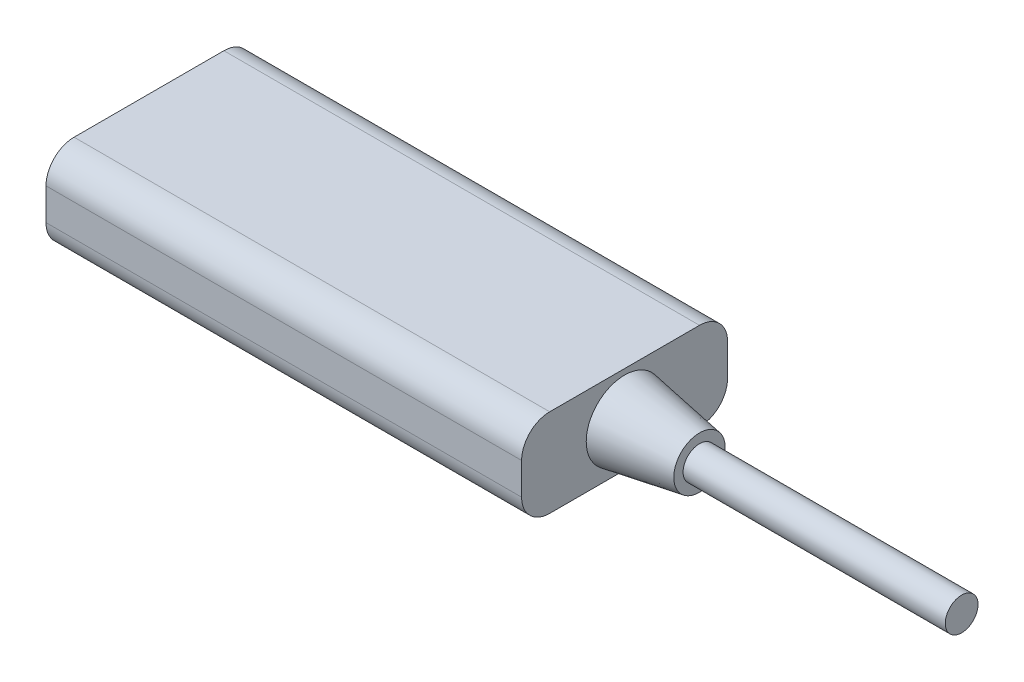
ISO-10303-21;
HEADER;
FILE_DESCRIPTION(('STEP AP214'),'2;1');
FILE_NAME('part.step','',(''),(''),'','','');
FILE_SCHEMA(('AUTOMOTIVE_DESIGN { 1 0 10303 214 1 1 1 1 }'));
ENDSEC;
DATA;
#1=APPLICATION_CONTEXT('core data for automotive mechanical design processes');
#2=APPLICATION_PROTOCOL_DEFINITION('international standard','automotive_design',2000,#1);
#3=PRODUCT_CONTEXT('',#1,'mechanical');
#4=PRODUCT('Part','Part','',(#3));
#5=PRODUCT_RELATED_PRODUCT_CATEGORY('part','',(#4));
#6=PRODUCT_DEFINITION_FORMATION('','',#4);
#7=PRODUCT_DEFINITION_CONTEXT('part definition',#1,'design');
#8=PRODUCT_DEFINITION('design','',#6,#7);
#9=PRODUCT_DEFINITION_SHAPE('','',#8);
#10=(LENGTH_UNIT() NAMED_UNIT(*) SI_UNIT(.MILLI.,.METRE.));
#11=(NAMED_UNIT(*) PLANE_ANGLE_UNIT() SI_UNIT($,.RADIAN.));
#12=(NAMED_UNIT(*) SI_UNIT($,.STERADIAN.) SOLID_ANGLE_UNIT());
#13=UNCERTAINTY_MEASURE_WITH_UNIT(LENGTH_MEASURE(1.E-05),#10,'distance_accuracy_value','');
#14=(GEOMETRIC_REPRESENTATION_CONTEXT(3) GLOBAL_UNCERTAINTY_ASSIGNED_CONTEXT((#13)) GLOBAL_UNIT_ASSIGNED_CONTEXT((#10,
#11,#12)) REPRESENTATION_CONTEXT('',''));
#15=CARTESIAN_POINT('',(0.,0.,0.));
#16=DIRECTION('',(0.,0.,1.));
#17=DIRECTION('',(1.,0.,0.));
#18=AXIS2_PLACEMENT_3D('',#15,#16,#17);
#19=CARTESIAN_POINT('',(-50.8,-4.7,-11.));
#20=DIRECTION('',(0.,-1.,0.));
#21=DIRECTION('',(0.,0.,-1.));
#22=AXIS2_PLACEMENT_3D('',#19,#20,#21);
#23=PLANE('',#22);
#24=DIRECTION('',(0.,0.,-1.));
#25=VECTOR('',#24,1.);
#26=CARTESIAN_POINT('',(-50.8,-4.7,-11.));
#27=LINE('',#26,#25);
#28=CARTESIAN_POINT('',(-50.8,-4.7,8.));
#29=VERTEX_POINT('',#28);
#30=CARTESIAN_POINT('',(-50.8,-4.7,-8.));
#31=VERTEX_POINT('',#30);
#32=EDGE_CURVE('E163',#29,#31,#27,.T.);
#33=ORIENTED_EDGE('',*,*,#32,.T.);
#34=DIRECTION('',(1.,0.,0.));
#35=VECTOR('',#34,1.);
#36=CARTESIAN_POINT('',(-50.8,-4.7,-8.));
#37=LINE('',#36,#35);
#38=CARTESIAN_POINT('',(0.,-4.7,-8.));
#39=VERTEX_POINT('',#38);
#40=EDGE_CURVE('E118',#31,#39,#37,.T.);
#41=ORIENTED_EDGE('',*,*,#40,.T.);
#42=DIRECTION('',(0.,0.,-1.));
#43=VECTOR('',#42,1.);
#44=CARTESIAN_POINT('',(0.,-4.7,-11.));
#45=LINE('',#44,#43);
#46=CARTESIAN_POINT('',(0.,-4.7,8.));
#47=VERTEX_POINT('',#46);
#48=EDGE_CURVE('E103',#47,#39,#45,.T.);
#49=ORIENTED_EDGE('',*,*,#48,.F.);
#50=DIRECTION('',(1.,0.,0.));
#51=VECTOR('',#50,1.);
#52=CARTESIAN_POINT('',(-50.8,-4.7,8.));
#53=LINE('',#52,#51);
#54=EDGE_CURVE('E115',#47,#29,#53,.F.);
#55=ORIENTED_EDGE('',*,*,#54,.T.);
#56=EDGE_LOOP('',(#33,#41,#49,#55));
#57=FACE_BOUND('',#56,.T.);
#58=ADVANCED_FACE('F33',(#57),#23,.T.);
#59=CARTESIAN_POINT('',(-50.8,-4.7,11.));
#60=DIRECTION('',(0.,0.,1.));
#61=DIRECTION('',(1.,0.,0.));
#62=AXIS2_PLACEMENT_3D('',#59,#60,#61);
#63=PLANE('',#62);
#64=DIRECTION('',(0.,-1.,0.));
#65=VECTOR('',#64,1.);
#66=CARTESIAN_POINT('',(-50.8,-4.7,11.));
#67=LINE('',#66,#65);
#68=CARTESIAN_POINT('',(-50.8,1.7,11.));
#69=VERTEX_POINT('',#68);
#70=CARTESIAN_POINT('',(-50.8,-1.7,11.));
#71=VERTEX_POINT('',#70);
#72=EDGE_CURVE('E125',#69,#71,#67,.T.);
#73=ORIENTED_EDGE('',*,*,#72,.T.);
#74=DIRECTION('',(1.,0.,0.));
#75=VECTOR('',#74,1.);
#76=CARTESIAN_POINT('',(-50.8,-1.7,11.));
#77=LINE('',#76,#75);
#78=CARTESIAN_POINT('',(0.,-1.7,11.));
#79=VERTEX_POINT('',#78);
#80=EDGE_CURVE('E11',#71,#79,#77,.T.);
#81=ORIENTED_EDGE('',*,*,#80,.T.);
#82=DIRECTION('',(0.,-1.,0.));
#83=VECTOR('',#82,1.);
#84=CARTESIAN_POINT('',(0.,-4.7,11.));
#85=LINE('',#84,#83);
#86=CARTESIAN_POINT('',(0.,1.7,11.));
#87=VERTEX_POINT('',#86);
#88=EDGE_CURVE('E105',#87,#79,#85,.T.);
#89=ORIENTED_EDGE('',*,*,#88,.F.);
#90=DIRECTION('',(1.,0.,0.));
#91=VECTOR('',#90,1.);
#92=CARTESIAN_POINT('',(-50.8,1.7,11.));
#93=LINE('',#92,#91);
#94=EDGE_CURVE('E41',#87,#69,#93,.F.);
#95=ORIENTED_EDGE('',*,*,#94,.T.);
#96=EDGE_LOOP('',(#73,#81,#89,#95));
#97=FACE_BOUND('',#96,.T.);
#98=ADVANCED_FACE('F154',(#97),#63,.T.);
#99=CARTESIAN_POINT('',(-50.8,4.7,-11.));
#100=DIRECTION('',(0.,1.,0.));
#101=DIRECTION('',(0.,0.,1.));
#102=AXIS2_PLACEMENT_3D('',#99,#100,#101);
#103=PLANE('',#102);
#104=DIRECTION('',(0.,0.,1.));
#105=VECTOR('',#104,1.);
#106=CARTESIAN_POINT('',(0.,4.7,-11.));
#107=LINE('',#106,#105);
#108=CARTESIAN_POINT('',(0.,4.7,-8.));
#109=VERTEX_POINT('',#108);
#110=CARTESIAN_POINT('',(0.,4.7,8.));
#111=VERTEX_POINT('',#110);
#112=EDGE_CURVE('E161',#109,#111,#107,.T.);
#113=ORIENTED_EDGE('',*,*,#112,.F.);
#114=DIRECTION('',(1.,0.,0.));
#115=VECTOR('',#114,1.);
#116=CARTESIAN_POINT('',(-50.8,4.7,-8.));
#117=LINE('',#116,#115);
#118=CARTESIAN_POINT('',(-50.8,4.7,-8.));
#119=VERTEX_POINT('',#118);
#120=EDGE_CURVE('E55',#109,#119,#117,.F.);
#121=ORIENTED_EDGE('',*,*,#120,.T.);
#122=DIRECTION('',(0.,0.,1.));
#123=VECTOR('',#122,1.);
#124=CARTESIAN_POINT('',(-50.8,4.7,-11.));
#125=LINE('',#124,#123);
#126=CARTESIAN_POINT('',(-50.8,4.7,8.));
#127=VERTEX_POINT('',#126);
#128=EDGE_CURVE('E129',#119,#127,#125,.T.);
#129=ORIENTED_EDGE('',*,*,#128,.T.);
#130=DIRECTION('',(1.,0.,0.));
#131=VECTOR('',#130,1.);
#132=CARTESIAN_POINT('',(-50.8,4.7,8.));
#133=LINE('',#132,#131);
#134=EDGE_CURVE('E149',#127,#111,#133,.T.);
#135=ORIENTED_EDGE('',*,*,#134,.T.);
#136=EDGE_LOOP('',(#113,#121,#129,#135));
#137=FACE_BOUND('',#136,.T.);
#138=ADVANCED_FACE('F160',(#137),#103,.T.);
#139=CARTESIAN_POINT('',(-50.8,-4.7,-11.));
#140=DIRECTION('',(0.,0.,-1.));
#141=DIRECTION('',(-1.,0.,0.));
#142=AXIS2_PLACEMENT_3D('',#139,#140,#141);
#143=PLANE('',#142);
#144=DIRECTION('',(0.,1.,0.));
#145=VECTOR('',#144,1.);
#146=CARTESIAN_POINT('',(0.,-4.7,-11.));
#147=LINE('',#146,#145);
#148=CARTESIAN_POINT('',(0.,-1.7,-11.));
#149=VERTEX_POINT('',#148);
#150=CARTESIAN_POINT('',(0.,1.7,-11.));
#151=VERTEX_POINT('',#150);
#152=EDGE_CURVE('E119',#149,#151,#147,.T.);
#153=ORIENTED_EDGE('',*,*,#152,.F.);
#154=DIRECTION('',(1.,0.,0.));
#155=VECTOR('',#154,1.);
#156=CARTESIAN_POINT('',(-50.8,-1.7,-11.));
#157=LINE('',#156,#155);
#158=CARTESIAN_POINT('',(-50.8,-1.7,-11.));
#159=VERTEX_POINT('',#158);
#160=EDGE_CURVE('E141',#149,#159,#157,.F.);
#161=ORIENTED_EDGE('',*,*,#160,.T.);
#162=DIRECTION('',(0.,1.,0.));
#163=VECTOR('',#162,1.);
#164=CARTESIAN_POINT('',(-50.8,-4.7,-11.));
#165=LINE('',#164,#163);
#166=CARTESIAN_POINT('',(-50.8,1.7,-11.));
#167=VERTEX_POINT('',#166);
#168=EDGE_CURVE('E167',#159,#167,#165,.T.);
#169=ORIENTED_EDGE('',*,*,#168,.T.);
#170=DIRECTION('',(1.,0.,0.));
#171=VECTOR('',#170,1.);
#172=CARTESIAN_POINT('',(-50.8,1.7,-11.));
#173=LINE('',#172,#171);
#174=EDGE_CURVE('E138',#167,#151,#173,.T.);
#175=ORIENTED_EDGE('',*,*,#174,.T.);
#176=EDGE_LOOP('',(#153,#161,#169,#175));
#177=FACE_BOUND('',#176,.T.);
#178=ADVANCED_FACE('F206',(#177),#143,.T.);
#179=CARTESIAN_POINT('',(-50.8,0.,0.));
#180=DIRECTION('',(-1.,0.,0.));
#181=DIRECTION('',(0.,0.,1.));
#182=AXIS2_PLACEMENT_3D('',#179,#180,#181);
#183=PLANE('',#182);
#184=CARTESIAN_POINT('',(-50.8,0.600000000000005,-4.4));
#185=DIRECTION('',(-1.,0.,0.));
#186=DIRECTION('',(0.,0.,1.));
#187=AXIS2_PLACEMENT_3D('',#184,#185,#186);
#188=CIRCLE('',#187,1.65);
#189=CARTESIAN_POINT('',(-50.8,0.600000000000005,-2.75));
#190=VERTEX_POINT('',#189);
#191=EDGE_CURVE('E189',#190,#190,#188,.T.);
#192=ORIENTED_EDGE('',*,*,#191,.F.);
#193=EDGE_LOOP('',(#192));
#194=FACE_BOUND('',#193,.T.);
#195=CARTESIAN_POINT('',(-50.8,0.600000000000006,4.4));
#196=DIRECTION('',(-1.,0.,0.));
#197=DIRECTION('',(0.,0.,1.));
#198=AXIS2_PLACEMENT_3D('',#195,#196,#197);
#199=CIRCLE('',#198,1.65);
#200=CARTESIAN_POINT('',(-50.8,0.600000000000006,6.05));
#201=VERTEX_POINT('',#200);
#202=EDGE_CURVE('E183',#201,#201,#199,.T.);
#203=ORIENTED_EDGE('',*,*,#202,.F.);
#204=EDGE_LOOP('',(#203));
#205=FACE_BOUND('',#204,.T.);
#206=ORIENTED_EDGE('',*,*,#168,.F.);
#207=CARTESIAN_POINT('',(-50.8,-1.7,-8.));
#208=DIRECTION('',(-1.,0.,0.));
#209=DIRECTION('',(0.,0.,1.));
#210=AXIS2_PLACEMENT_3D('',#207,#208,#209);
#211=CIRCLE('',#210,3.);
#212=EDGE_CURVE('E147',#159,#31,#211,.T.);
#213=ORIENTED_EDGE('',*,*,#212,.T.);
#214=ORIENTED_EDGE('',*,*,#32,.F.);
#215=CARTESIAN_POINT('',(-50.8,-1.7,8.));
#216=DIRECTION('',(-1.,0.,0.));
#217=DIRECTION('',(0.,0.,1.));
#218=AXIS2_PLACEMENT_3D('',#215,#216,#217);
#219=CIRCLE('',#218,3.);
#220=EDGE_CURVE('E124',#29,#71,#219,.T.);
#221=ORIENTED_EDGE('',*,*,#220,.T.);
#222=ORIENTED_EDGE('',*,*,#72,.F.);
#223=CARTESIAN_POINT('',(-50.8,1.7,8.));
#224=DIRECTION('',(-1.,0.,0.));
#225=DIRECTION('',(0.,0.,1.));
#226=AXIS2_PLACEMENT_3D('',#223,#224,#225);
#227=CIRCLE('',#226,3.);
#228=EDGE_CURVE('E48',#69,#127,#227,.T.);
#229=ORIENTED_EDGE('',*,*,#228,.T.);
#230=ORIENTED_EDGE('',*,*,#128,.F.);
#231=CARTESIAN_POINT('',(-50.8,1.7,-8.));
#232=DIRECTION('',(-1.,0.,0.));
#233=DIRECTION('',(0.,0.,1.));
#234=AXIS2_PLACEMENT_3D('',#231,#232,#233);
#235=CIRCLE('',#234,3.);
#236=EDGE_CURVE('E145',#119,#167,#235,.T.);
#237=ORIENTED_EDGE('',*,*,#236,.T.);
#238=EDGE_LOOP('',(#206,#213,#214,#221,#222,#229,#230,#237));
#239=FACE_BOUND('',#238,.T.);
#240=ADVANCED_FACE('F157',(#194,#205,#239),#183,.T.);
#241=CARTESIAN_POINT('',(0.,0.,0.));
#242=DIRECTION('',(-1.,0.,0.));
#243=DIRECTION('',(0.,0.,1.));
#244=AXIS2_PLACEMENT_3D('',#241,#242,#243);
#245=PLANE('',#244);
#246=CARTESIAN_POINT('',(0.,0.,0.));
#247=DIRECTION('',(-1.,0.,0.));
#248=DIRECTION('',(0.,0.,1.));
#249=AXIS2_PLACEMENT_3D('',#246,#247,#248);
#250=CIRCLE('',#249,4.1);
#251=CARTESIAN_POINT('',(0.,0.,4.1));
#252=VERTEX_POINT('',#251);
#253=EDGE_CURVE('E120',#252,#252,#250,.T.);
#254=ORIENTED_EDGE('',*,*,#253,.T.);
#255=EDGE_LOOP('',(#254));
#256=FACE_BOUND('',#255,.T.);
#257=ORIENTED_EDGE('',*,*,#48,.T.);
#258=CARTESIAN_POINT('',(0.,-1.7,-8.));
#259=DIRECTION('',(-1.,0.,0.));
#260=DIRECTION('',(0.,0.,1.));
#261=AXIS2_PLACEMENT_3D('',#258,#259,#260);
#262=CIRCLE('',#261,3.);
#263=EDGE_CURVE('E136',#39,#149,#262,.F.);
#264=ORIENTED_EDGE('',*,*,#263,.T.);
#265=ORIENTED_EDGE('',*,*,#152,.T.);
#266=CARTESIAN_POINT('',(0.,1.7,-8.));
#267=DIRECTION('',(-1.,0.,0.));
#268=DIRECTION('',(0.,0.,1.));
#269=AXIS2_PLACEMENT_3D('',#266,#267,#268);
#270=CIRCLE('',#269,3.);
#271=EDGE_CURVE('E109',#151,#109,#270,.F.);
#272=ORIENTED_EDGE('',*,*,#271,.T.);
#273=ORIENTED_EDGE('',*,*,#112,.T.);
#274=CARTESIAN_POINT('',(0.,1.7,8.));
#275=DIRECTION('',(-1.,0.,0.));
#276=DIRECTION('',(0.,0.,1.));
#277=AXIS2_PLACEMENT_3D('',#274,#275,#276);
#278=CIRCLE('',#277,3.);
#279=EDGE_CURVE('E110',#111,#87,#278,.F.);
#280=ORIENTED_EDGE('',*,*,#279,.T.);
#281=ORIENTED_EDGE('',*,*,#88,.T.);
#282=CARTESIAN_POINT('',(0.,-1.7,8.));
#283=DIRECTION('',(-1.,0.,0.));
#284=DIRECTION('',(0.,0.,1.));
#285=AXIS2_PLACEMENT_3D('',#282,#283,#284);
#286=CIRCLE('',#285,3.);
#287=EDGE_CURVE('E100',#79,#47,#286,.F.);
#288=ORIENTED_EDGE('',*,*,#287,.T.);
#289=EDGE_LOOP('',(#257,#264,#265,#272,#273,#280,#281,#288));
#290=FACE_BOUND('',#289,.T.);
#291=ADVANCED_FACE('F102',(#256,#290),#245,.F.);
#292=CARTESIAN_POINT('',(8.,0.,0.));
#293=DIRECTION('',(-1.,0.,0.));
#294=DIRECTION('',(0.,0.,1.));
#295=AXIS2_PLACEMENT_3D('',#292,#293,#294);
#296=CONICAL_SURFACE('',#295,2.75,0.167175017093078);
#297=ORIENTED_EDGE('',*,*,#253,.F.);
#298=EDGE_LOOP('',(#297));
#299=FACE_BOUND('',#298,.T.);
#300=CARTESIAN_POINT('',(8.,0.,0.));
#301=DIRECTION('',(-1.,0.,0.));
#302=DIRECTION('',(0.,0.,1.));
#303=AXIS2_PLACEMENT_3D('',#300,#301,#302);
#304=CIRCLE('',#303,2.75);
#305=CARTESIAN_POINT('',(8.,0.,2.75));
#306=VERTEX_POINT('',#305);
#307=EDGE_CURVE('E179',#306,#306,#304,.T.);
#308=ORIENTED_EDGE('',*,*,#307,.T.);
#309=EDGE_LOOP('',(#308));
#310=FACE_BOUND('',#309,.T.);
#311=ADVANCED_FACE('F292',(#299,#310),#296,.T.);
#312=CARTESIAN_POINT('',(36.,0.,0.));
#313=DIRECTION('',(-1.,0.,0.));
#314=DIRECTION('',(0.,0.,1.));
#315=AXIS2_PLACEMENT_3D('',#312,#313,#314);
#316=PLANE('',#315);
#317=CARTESIAN_POINT('',(36.,0.,0.));
#318=DIRECTION('',(-1.,0.,0.));
#319=DIRECTION('',(0.,0.,1.));
#320=AXIS2_PLACEMENT_3D('',#317,#318,#319);
#321=CIRCLE('',#320,1.75);
#322=CARTESIAN_POINT('',(36.,0.,1.75));
#323=VERTEX_POINT('',#322);
#324=EDGE_CURVE('E173',#323,#323,#321,.T.);
#325=ORIENTED_EDGE('',*,*,#324,.F.);
#326=EDGE_LOOP('',(#325));
#327=FACE_BOUND('',#326,.T.);
#328=ADVANCED_FACE('F300',(#327),#316,.F.);
#329=CARTESIAN_POINT('',(0.,0.,0.));
#330=DIRECTION('',(-1.,0.,0.));
#331=DIRECTION('',(0.,0.,1.));
#332=AXIS2_PLACEMENT_3D('',#329,#330,#331);
#333=CYLINDRICAL_SURFACE('',#332,1.75);
#334=CARTESIAN_POINT('',(8.,0.,0.));
#335=DIRECTION('',(-1.,0.,0.));
#336=DIRECTION('',(0.,0.,1.));
#337=AXIS2_PLACEMENT_3D('',#334,#335,#336);
#338=CIRCLE('',#337,1.75);
#339=CARTESIAN_POINT('',(8.,0.,1.75));
#340=VERTEX_POINT('',#339);
#341=EDGE_CURVE('E176',#340,#340,#338,.T.);
#342=ORIENTED_EDGE('',*,*,#341,.F.);
#343=EDGE_LOOP('',(#342));
#344=FACE_BOUND('',#343,.T.);
#345=ORIENTED_EDGE('',*,*,#324,.T.);
#346=EDGE_LOOP('',(#345));
#347=FACE_BOUND('',#346,.T.);
#348=ADVANCED_FACE('F308',(#344,#347),#333,.T.);
#349=CARTESIAN_POINT('',(8.,0.,0.));
#350=DIRECTION('',(-1.,0.,0.));
#351=DIRECTION('',(0.,0.,1.));
#352=AXIS2_PLACEMENT_3D('',#349,#350,#351);
#353=PLANE('',#352);
#354=ORIENTED_EDGE('',*,*,#307,.F.);
#355=EDGE_LOOP('',(#354));
#356=FACE_BOUND('',#355,.T.);
#357=ORIENTED_EDGE('',*,*,#341,.T.);
#358=EDGE_LOOP('',(#357));
#359=FACE_BOUND('',#358,.T.);
#360=ADVANCED_FACE('F235',(#356,#359),#353,.F.);
#361=CARTESIAN_POINT('',(-50.8,-1.7,-8.));
#362=DIRECTION('',(1.,0.,0.));
#363=DIRECTION('',(0.,0.,-1.));
#364=AXIS2_PLACEMENT_3D('',#361,#362,#363);
#365=CYLINDRICAL_SURFACE('',#364,3.);
#366=ORIENTED_EDGE('',*,*,#212,.F.);
#367=ORIENTED_EDGE('',*,*,#160,.F.);
#368=ORIENTED_EDGE('',*,*,#263,.F.);
#369=ORIENTED_EDGE('',*,*,#40,.F.);
#370=EDGE_LOOP('',(#366,#367,#368,#369));
#371=FACE_BOUND('',#370,.T.);
#372=ADVANCED_FACE('F231',(#371),#365,.T.);
#373=CARTESIAN_POINT('',(-50.8,1.7,-8.));
#374=DIRECTION('',(1.,0.,0.));
#375=DIRECTION('',(0.,0.,-1.));
#376=AXIS2_PLACEMENT_3D('',#373,#374,#375);
#377=CYLINDRICAL_SURFACE('',#376,3.);
#378=ORIENTED_EDGE('',*,*,#236,.F.);
#379=ORIENTED_EDGE('',*,*,#120,.F.);
#380=ORIENTED_EDGE('',*,*,#271,.F.);
#381=ORIENTED_EDGE('',*,*,#174,.F.);
#382=EDGE_LOOP('',(#378,#379,#380,#381));
#383=FACE_BOUND('',#382,.T.);
#384=ADVANCED_FACE('F234',(#383),#377,.T.);
#385=CARTESIAN_POINT('',(-50.8,-1.7,8.));
#386=DIRECTION('',(1.,0.,0.));
#387=DIRECTION('',(0.,0.,-1.));
#388=AXIS2_PLACEMENT_3D('',#385,#386,#387);
#389=CYLINDRICAL_SURFACE('',#388,3.);
#390=ORIENTED_EDGE('',*,*,#220,.F.);
#391=ORIENTED_EDGE('',*,*,#54,.F.);
#392=ORIENTED_EDGE('',*,*,#287,.F.);
#393=ORIENTED_EDGE('',*,*,#80,.F.);
#394=EDGE_LOOP('',(#390,#391,#392,#393));
#395=FACE_BOUND('',#394,.T.);
#396=ADVANCED_FACE('F123',(#395),#389,.T.);
#397=CARTESIAN_POINT('',(-50.8,1.7,8.));
#398=DIRECTION('',(1.,0.,0.));
#399=DIRECTION('',(0.,0.,-1.));
#400=AXIS2_PLACEMENT_3D('',#397,#398,#399);
#401=CYLINDRICAL_SURFACE('',#400,3.);
#402=ORIENTED_EDGE('',*,*,#228,.F.);
#403=ORIENTED_EDGE('',*,*,#94,.F.);
#404=ORIENTED_EDGE('',*,*,#279,.F.);
#405=ORIENTED_EDGE('',*,*,#134,.F.);
#406=EDGE_LOOP('',(#402,#403,#404,#405));
#407=FACE_BOUND('',#406,.T.);
#408=ADVANCED_FACE('F35',(#407),#401,.T.);
#409=CARTESIAN_POINT('',(-40.8,0.600000000000006,4.4));
#410=DIRECTION('',(-1.,0.,0.));
#411=DIRECTION('',(0.,0.,1.));
#412=AXIS2_PLACEMENT_3D('',#409,#410,#411);
#413=CYLINDRICAL_SURFACE('',#412,1.65);
#414=CARTESIAN_POINT('',(-40.8,0.600000000000006,4.4));
#415=DIRECTION('',(-1.,0.,0.));
#416=DIRECTION('',(0.,0.,1.));
#417=AXIS2_PLACEMENT_3D('',#414,#415,#416);
#418=CIRCLE('',#417,1.65);
#419=CARTESIAN_POINT('',(-40.8,0.600000000000006,6.05));
#420=VERTEX_POINT('',#419);
#421=EDGE_CURVE('E186',#420,#420,#418,.T.);
#422=ORIENTED_EDGE('',*,*,#421,.F.);
#423=EDGE_LOOP('',(#422));
#424=FACE_BOUND('',#423,.T.);
#425=ORIENTED_EDGE('',*,*,#202,.T.);
#426=EDGE_LOOP('',(#425));
#427=FACE_BOUND('',#426,.T.);
#428=ADVANCED_FACE('F210',(#424,#427),#413,.F.);
#429=CARTESIAN_POINT('',(-40.8,0.600000000000006,4.4));
#430=DIRECTION('',(-1.,0.,0.));
#431=DIRECTION('',(0.,0.,1.));
#432=AXIS2_PLACEMENT_3D('',#429,#430,#431);
#433=PLANE('',#432);
#434=ORIENTED_EDGE('',*,*,#421,.T.);
#435=EDGE_LOOP('',(#434));
#436=FACE_BOUND('',#435,.T.);
#437=ADVANCED_FACE('F200',(#436),#433,.T.);
#438=CARTESIAN_POINT('',(-40.8,0.600000000000005,-4.4));
#439=DIRECTION('',(-1.,0.,0.));
#440=DIRECTION('',(0.,0.,1.));
#441=AXIS2_PLACEMENT_3D('',#438,#439,#440);
#442=CYLINDRICAL_SURFACE('',#441,1.65);
#443=CARTESIAN_POINT('',(-40.8,0.600000000000005,-4.4));
#444=DIRECTION('',(-1.,0.,0.));
#445=DIRECTION('',(0.,0.,1.));
#446=AXIS2_PLACEMENT_3D('',#443,#444,#445);
#447=CIRCLE('',#446,1.65);
#448=CARTESIAN_POINT('',(-40.8,0.600000000000005,-2.75));
#449=VERTEX_POINT('',#448);
#450=EDGE_CURVE('E182',#449,#449,#447,.T.);
#451=ORIENTED_EDGE('',*,*,#450,.F.);
#452=EDGE_LOOP('',(#451));
#453=FACE_BOUND('',#452,.T.);
#454=ORIENTED_EDGE('',*,*,#191,.T.);
#455=EDGE_LOOP('',(#454));
#456=FACE_BOUND('',#455,.T.);
#457=ADVANCED_FACE('F197',(#453,#456),#442,.F.);
#458=CARTESIAN_POINT('',(-40.8,0.600000000000005,-4.4));
#459=DIRECTION('',(-1.,0.,0.));
#460=DIRECTION('',(0.,0.,1.));
#461=AXIS2_PLACEMENT_3D('',#458,#459,#460);
#462=PLANE('',#461);
#463=ORIENTED_EDGE('',*,*,#450,.T.);
#464=EDGE_LOOP('',(#463));
#465=FACE_BOUND('',#464,.T.);
#466=ADVANCED_FACE('F195',(#465),#462,.T.);
#467=CLOSED_SHELL('',(#58,#98,#138,#178,#240,#291,#311,#328,#348,#360,#372,#384,#396,#408,#428,
#437,#457,#466));
#468=MANIFOLD_SOLID_BREP('B2',#467);
#469=ADVANCED_BREP_SHAPE_REPRESENTATION('',(#18,#468),#14);
#470=SHAPE_DEFINITION_REPRESENTATION(#9,#469);
ENDSEC;
END-ISO-10303-21;
